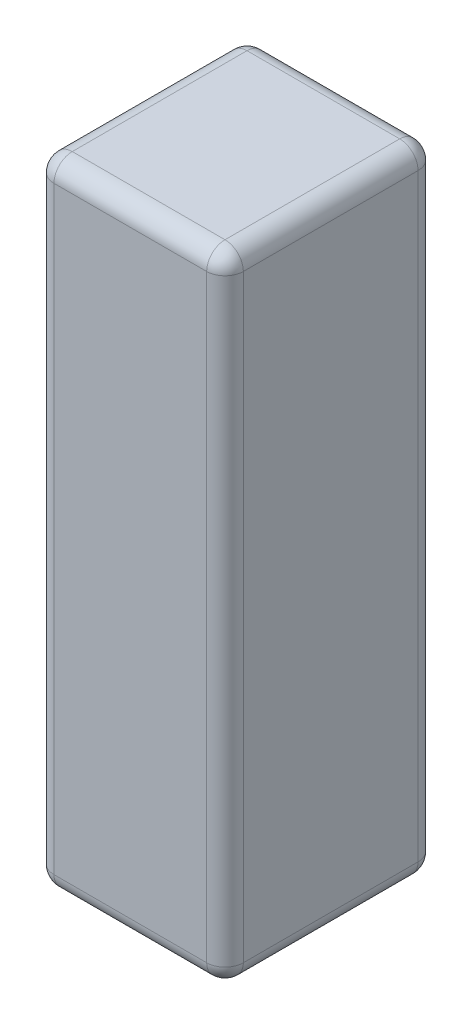
ISO-10303-21;
HEADER;
FILE_DESCRIPTION(('STEP AP214'),'2;1');
FILE_NAME('part.step','',(''),(''),'','','');
FILE_SCHEMA(('AUTOMOTIVE_DESIGN { 1 0 10303 214 1 1 1 1 }'));
ENDSEC;
DATA;
#1=APPLICATION_CONTEXT('core data for automotive mechanical design processes');
#2=APPLICATION_PROTOCOL_DEFINITION('international standard','automotive_design',2000,#1);
#3=PRODUCT_CONTEXT('',#1,'mechanical');
#4=PRODUCT('Part','Part','',(#3));
#5=PRODUCT_RELATED_PRODUCT_CATEGORY('part','',(#4));
#6=PRODUCT_DEFINITION_FORMATION('','',#4);
#7=PRODUCT_DEFINITION_CONTEXT('part definition',#1,'design');
#8=PRODUCT_DEFINITION('design','',#6,#7);
#9=PRODUCT_DEFINITION_SHAPE('','',#8);
#10=(LENGTH_UNIT() NAMED_UNIT(*) SI_UNIT(.MILLI.,.METRE.));
#11=(NAMED_UNIT(*) PLANE_ANGLE_UNIT() SI_UNIT($,.RADIAN.));
#12=(NAMED_UNIT(*) SI_UNIT($,.STERADIAN.) SOLID_ANGLE_UNIT());
#13=UNCERTAINTY_MEASURE_WITH_UNIT(LENGTH_MEASURE(1.E-05),#10,'distance_accuracy_value','');
#14=(GEOMETRIC_REPRESENTATION_CONTEXT(3) GLOBAL_UNCERTAINTY_ASSIGNED_CONTEXT((#13)) GLOBAL_UNIT_ASSIGNED_CONTEXT((#10,
#11,#12)) REPRESENTATION_CONTEXT('',''));
#15=CARTESIAN_POINT('',(0.,0.,0.));
#16=DIRECTION('',(0.,0.,1.));
#17=DIRECTION('',(1.,0.,0.));
#18=AXIS2_PLACEMENT_3D('',#15,#16,#17);
#19=CARTESIAN_POINT('',(0.,104.,0.));
#20=DIRECTION('',(1.,0.,0.));
#21=DIRECTION('',(0.,0.,-1.));
#22=AXIS2_PLACEMENT_3D('',#19,#20,#21);
#23=PLANE('',#22);
#24=DIRECTION('',(0.,0.,1.));
#25=VECTOR('',#24,1.);
#26=CARTESIAN_POINT('',(0.,101.,0.));
#27=LINE('',#26,#25);
#28=CARTESIAN_POINT('',(0.,101.,-3.));
#29=VERTEX_POINT('',#28);
#30=CARTESIAN_POINT('',(0.,101.,-31.6));
#31=VERTEX_POINT('',#30);
#32=EDGE_CURVE('E153',#29,#31,#27,.F.);
#33=ORIENTED_EDGE('',*,*,#32,.T.);
#34=DIRECTION('',(0.,-1.,0.));
#35=VECTOR('',#34,1.);
#36=CARTESIAN_POINT('',(0.,104.,-31.6));
#37=LINE('',#36,#35);
#38=CARTESIAN_POINT('',(0.,3.,-31.6));
#39=VERTEX_POINT('',#38);
#40=EDGE_CURVE('E221',#31,#39,#37,.T.);
#41=ORIENTED_EDGE('',*,*,#40,.T.);
#42=DIRECTION('',(0.,0.,1.));
#43=VECTOR('',#42,1.);
#44=CARTESIAN_POINT('',(0.,3.,0.));
#45=LINE('',#44,#43);
#46=CARTESIAN_POINT('',(0.,3.,-3.));
#47=VERTEX_POINT('',#46);
#48=EDGE_CURVE('E280',#39,#47,#45,.T.);
#49=ORIENTED_EDGE('',*,*,#48,.T.);
#50=DIRECTION('',(0.,-1.,0.));
#51=VECTOR('',#50,1.);
#52=CARTESIAN_POINT('',(0.,104.,-3.));
#53=LINE('',#52,#51);
#54=EDGE_CURVE('E278',#47,#29,#53,.F.);
#55=ORIENTED_EDGE('',*,*,#54,.T.);
#56=EDGE_LOOP('',(#33,#41,#49,#55));
#57=FACE_BOUND('',#56,.T.);
#58=ADVANCED_FACE('F34',(#57),#23,.F.);
#59=CARTESIAN_POINT('',(0.,104.,0.));
#60=DIRECTION('',(0.,0.,-1.));
#61=DIRECTION('',(-1.,0.,0.));
#62=AXIS2_PLACEMENT_3D('',#59,#60,#61);
#63=PLANE('',#62);
#64=DIRECTION('',(1.,0.,0.));
#65=VECTOR('',#64,1.);
#66=CARTESIAN_POINT('',(0.,101.,0.));
#67=LINE('',#66,#65);
#68=CARTESIAN_POINT('',(28.,101.,0.));
#69=VERTEX_POINT('',#68);
#70=CARTESIAN_POINT('',(3.,101.,0.));
#71=VERTEX_POINT('',#70);
#72=EDGE_CURVE('E43',#69,#71,#67,.F.);
#73=ORIENTED_EDGE('',*,*,#72,.T.);
#74=DIRECTION('',(0.,-1.,0.));
#75=VECTOR('',#74,1.);
#76=CARTESIAN_POINT('',(3.,104.,0.));
#77=LINE('',#76,#75);
#78=CARTESIAN_POINT('',(3.,3.,0.));
#79=VERTEX_POINT('',#78);
#80=EDGE_CURVE('E11',#71,#79,#77,.T.);
#81=ORIENTED_EDGE('',*,*,#80,.T.);
#82=DIRECTION('',(1.,0.,0.));
#83=VECTOR('',#82,1.);
#84=CARTESIAN_POINT('',(31.,3.,0.));
#85=LINE('',#84,#83);
#86=CARTESIAN_POINT('',(28.,3.,0.));
#87=VERTEX_POINT('',#86);
#88=EDGE_CURVE('E227',#79,#87,#85,.T.);
#89=ORIENTED_EDGE('',*,*,#88,.T.);
#90=DIRECTION('',(0.,-1.,0.));
#91=VECTOR('',#90,1.);
#92=CARTESIAN_POINT('',(28.,104.,0.));
#93=LINE('',#92,#91);
#94=EDGE_CURVE('E54',#87,#69,#93,.F.);
#95=ORIENTED_EDGE('',*,*,#94,.T.);
#96=EDGE_LOOP('',(#73,#81,#89,#95));
#97=FACE_BOUND('',#96,.T.);
#98=ADVANCED_FACE('F318',(#97),#63,.F.);
#99=CARTESIAN_POINT('',(31.,104.,0.));
#100=DIRECTION('',(-1.,0.,0.));
#101=DIRECTION('',(0.,0.,1.));
#102=AXIS2_PLACEMENT_3D('',#99,#100,#101);
#103=PLANE('',#102);
#104=DIRECTION('',(0.,-1.,0.));
#105=VECTOR('',#104,1.);
#106=CARTESIAN_POINT('',(31.,104.,-31.6));
#107=LINE('',#106,#105);
#108=CARTESIAN_POINT('',(31.,3.,-31.6));
#109=VERTEX_POINT('',#108);
#110=CARTESIAN_POINT('',(31.,101.,-31.6));
#111=VERTEX_POINT('',#110);
#112=EDGE_CURVE('E216',#109,#111,#107,.F.);
#113=ORIENTED_EDGE('',*,*,#112,.T.);
#114=DIRECTION('',(0.,0.,-1.));
#115=VECTOR('',#114,1.);
#116=CARTESIAN_POINT('',(31.,101.,0.));
#117=LINE('',#116,#115);
#118=CARTESIAN_POINT('',(31.,101.,-3.));
#119=VERTEX_POINT('',#118);
#120=EDGE_CURVE('E219',#111,#119,#117,.F.);
#121=ORIENTED_EDGE('',*,*,#120,.T.);
#122=DIRECTION('',(0.,-1.,0.));
#123=VECTOR('',#122,1.);
#124=CARTESIAN_POINT('',(31.,104.,-3.));
#125=LINE('',#124,#123);
#126=CARTESIAN_POINT('',(31.,3.,-3.));
#127=VERTEX_POINT('',#126);
#128=EDGE_CURVE('E217',#119,#127,#125,.T.);
#129=ORIENTED_EDGE('',*,*,#128,.T.);
#130=DIRECTION('',(0.,0.,-1.));
#131=VECTOR('',#130,1.);
#132=CARTESIAN_POINT('',(31.,3.,-34.6));
#133=LINE('',#132,#131);
#134=EDGE_CURVE('E213',#127,#109,#133,.T.);
#135=ORIENTED_EDGE('',*,*,#134,.T.);
#136=EDGE_LOOP('',(#113,#121,#129,#135));
#137=FACE_BOUND('',#136,.T.);
#138=ADVANCED_FACE('F298',(#137),#103,.F.);
#139=CARTESIAN_POINT('',(0.,104.,-34.6));
#140=DIRECTION('',(0.,0.,1.));
#141=DIRECTION('',(1.,0.,0.));
#142=AXIS2_PLACEMENT_3D('',#139,#140,#141);
#143=PLANE('',#142);
#144=DIRECTION('',(-1.,0.,0.));
#145=VECTOR('',#144,1.);
#146=CARTESIAN_POINT('',(0.,3.,-34.6));
#147=LINE('',#146,#145);
#148=CARTESIAN_POINT('',(28.,3.,-34.6));
#149=VERTEX_POINT('',#148);
#150=CARTESIAN_POINT('',(3.,3.,-34.6));
#151=VERTEX_POINT('',#150);
#152=EDGE_CURVE('E257',#149,#151,#147,.T.);
#153=ORIENTED_EDGE('',*,*,#152,.T.);
#154=DIRECTION('',(0.,-1.,0.));
#155=VECTOR('',#154,1.);
#156=CARTESIAN_POINT('',(3.,104.,-34.6));
#157=LINE('',#156,#155);
#158=CARTESIAN_POINT('',(3.,101.,-34.6));
#159=VERTEX_POINT('',#158);
#160=EDGE_CURVE('E263',#151,#159,#157,.F.);
#161=ORIENTED_EDGE('',*,*,#160,.T.);
#162=DIRECTION('',(-1.,0.,0.));
#163=VECTOR('',#162,1.);
#164=CARTESIAN_POINT('',(0.,101.,-34.6));
#165=LINE('',#164,#163);
#166=CARTESIAN_POINT('',(28.,101.,-34.6));
#167=VERTEX_POINT('',#166);
#168=EDGE_CURVE('E260',#159,#167,#165,.F.);
#169=ORIENTED_EDGE('',*,*,#168,.T.);
#170=DIRECTION('',(0.,-1.,0.));
#171=VECTOR('',#170,1.);
#172=CARTESIAN_POINT('',(28.,104.,-34.6));
#173=LINE('',#172,#171);
#174=EDGE_CURVE('E252',#167,#149,#173,.T.);
#175=ORIENTED_EDGE('',*,*,#174,.T.);
#176=EDGE_LOOP('',(#153,#161,#169,#175));
#177=FACE_BOUND('',#176,.T.);
#178=ADVANCED_FACE('F261',(#177),#143,.F.);
#179=CARTESIAN_POINT('',(0.,104.,0.));
#180=DIRECTION('',(0.,-1.,0.));
#181=DIRECTION('',(0.,0.,-1.));
#182=AXIS2_PLACEMENT_3D('',#179,#180,#181);
#183=PLANE('',#182);
#184=DIRECTION('',(0.,0.,-1.));
#185=VECTOR('',#184,1.);
#186=CARTESIAN_POINT('',(28.,104.,0.));
#187=LINE('',#186,#185);
#188=CARTESIAN_POINT('',(28.,104.,-3.));
#189=VERTEX_POINT('',#188);
#190=CARTESIAN_POINT('',(28.,104.,-31.6));
#191=VERTEX_POINT('',#190);
#192=EDGE_CURVE('E132',#189,#191,#187,.T.);
#193=ORIENTED_EDGE('',*,*,#192,.T.);
#194=DIRECTION('',(-1.,0.,0.));
#195=VECTOR('',#194,1.);
#196=CARTESIAN_POINT('',(0.,104.,-31.6));
#197=LINE('',#196,#195);
#198=CARTESIAN_POINT('',(3.,104.,-31.6));
#199=VERTEX_POINT('',#198);
#200=EDGE_CURVE('E128',#191,#199,#197,.T.);
#201=ORIENTED_EDGE('',*,*,#200,.T.);
#202=DIRECTION('',(0.,0.,1.));
#203=VECTOR('',#202,1.);
#204=CARTESIAN_POINT('',(3.,104.,0.));
#205=LINE('',#204,#203);
#206=CARTESIAN_POINT('',(3.,104.,-3.));
#207=VERTEX_POINT('',#206);
#208=EDGE_CURVE('E122',#199,#207,#205,.T.);
#209=ORIENTED_EDGE('',*,*,#208,.T.);
#210=DIRECTION('',(1.,0.,0.));
#211=VECTOR('',#210,1.);
#212=CARTESIAN_POINT('',(0.,104.,-3.));
#213=LINE('',#212,#211);
#214=EDGE_CURVE('E125',#207,#189,#213,.T.);
#215=ORIENTED_EDGE('',*,*,#214,.T.);
#216=EDGE_LOOP('',(#193,#201,#209,#215));
#217=FACE_BOUND('',#216,.T.);
#218=ADVANCED_FACE('F124',(#217),#183,.F.);
#219=CARTESIAN_POINT('',(0.,0.,0.));
#220=DIRECTION('',(0.,-1.,0.));
#221=DIRECTION('',(0.,0.,-1.));
#222=AXIS2_PLACEMENT_3D('',#219,#220,#221);
#223=PLANE('',#222);
#224=DIRECTION('',(0.,0.,1.));
#225=VECTOR('',#224,1.);
#226=CARTESIAN_POINT('',(3.,0.,-34.6));
#227=LINE('',#226,#225);
#228=CARTESIAN_POINT('',(3.,0.,-3.));
#229=VERTEX_POINT('',#228);
#230=CARTESIAN_POINT('',(3.,0.,-31.6));
#231=VERTEX_POINT('',#230);
#232=EDGE_CURVE('E274',#229,#231,#227,.F.);
#233=ORIENTED_EDGE('',*,*,#232,.T.);
#234=DIRECTION('',(-1.,0.,0.));
#235=VECTOR('',#234,1.);
#236=CARTESIAN_POINT('',(31.,0.,-31.6));
#237=LINE('',#236,#235);
#238=CARTESIAN_POINT('',(28.,0.,-31.6));
#239=VERTEX_POINT('',#238);
#240=EDGE_CURVE('E276',#231,#239,#237,.F.);
#241=ORIENTED_EDGE('',*,*,#240,.T.);
#242=DIRECTION('',(0.,0.,-1.));
#243=VECTOR('',#242,1.);
#244=CARTESIAN_POINT('',(28.,0.,0.));
#245=LINE('',#244,#243);
#246=CARTESIAN_POINT('',(28.,0.,-3.));
#247=VERTEX_POINT('',#246);
#248=EDGE_CURVE('E211',#239,#247,#245,.F.);
#249=ORIENTED_EDGE('',*,*,#248,.T.);
#250=DIRECTION('',(1.,0.,0.));
#251=VECTOR('',#250,1.);
#252=CARTESIAN_POINT('',(0.,0.,-3.));
#253=LINE('',#252,#251);
#254=EDGE_CURVE('E268',#247,#229,#253,.F.);
#255=ORIENTED_EDGE('',*,*,#254,.T.);
#256=EDGE_LOOP('',(#233,#241,#249,#255));
#257=FACE_BOUND('',#256,.T.);
#258=ADVANCED_FACE('F357',(#257),#223,.T.);
#259=CARTESIAN_POINT('',(0.,3.,-3.));
#260=DIRECTION('',(-1.,0.,0.));
#261=DIRECTION('',(0.,0.,1.));
#262=AXIS2_PLACEMENT_3D('',#259,#260,#261);
#263=CYLINDRICAL_SURFACE('',#262,3.);
#264=CARTESIAN_POINT('',(28.,3.,-3.));
#265=DIRECTION('',(1.,0.,0.));
#266=DIRECTION('',(0.,0.,-1.));
#267=AXIS2_PLACEMENT_3D('',#264,#265,#266);
#268=CIRCLE('',#267,3.);
#269=EDGE_CURVE('E38',#87,#247,#268,.T.);
#270=ORIENTED_EDGE('',*,*,#269,.F.);
#271=ORIENTED_EDGE('',*,*,#88,.F.);
#272=CARTESIAN_POINT('',(3.,3.,-3.));
#273=DIRECTION('',(-1.,0.,0.));
#274=DIRECTION('',(0.,0.,1.));
#275=AXIS2_PLACEMENT_3D('',#272,#273,#274);
#276=CIRCLE('',#275,3.);
#277=EDGE_CURVE('E191',#229,#79,#276,.T.);
#278=ORIENTED_EDGE('',*,*,#277,.F.);
#279=ORIENTED_EDGE('',*,*,#254,.F.);
#280=EDGE_LOOP('',(#270,#271,#278,#279));
#281=FACE_BOUND('',#280,.T.);
#282=ADVANCED_FACE('F36',(#281),#263,.T.);
#283=CARTESIAN_POINT('',(28.,3.,-3.));
#284=DIRECTION('',(0.,0.,1.));
#285=DIRECTION('',(1.,0.,0.));
#286=AXIS2_PLACEMENT_3D('',#283,#284,#285);
#287=SPHERICAL_SURFACE('',#286,3.);
#288=CARTESIAN_POINT('',(28.,3.,-3.));
#289=DIRECTION('',(0.,-1.,0.));
#290=DIRECTION('',(0.,0.,-1.));
#291=AXIS2_PLACEMENT_3D('',#288,#289,#290);
#292=CIRCLE('',#291,3.);
#293=EDGE_CURVE('E186',#87,#127,#292,.F.);
#294=ORIENTED_EDGE('',*,*,#293,.F.);
#295=ORIENTED_EDGE('',*,*,#269,.T.);
#296=CARTESIAN_POINT('',(28.,3.,-3.));
#297=DIRECTION('',(0.,0.,1.));
#298=DIRECTION('',(1.,0.,0.));
#299=AXIS2_PLACEMENT_3D('',#296,#297,#298);
#300=CIRCLE('',#299,3.);
#301=EDGE_CURVE('E189',#127,#247,#300,.F.);
#302=ORIENTED_EDGE('',*,*,#301,.F.);
#303=EDGE_LOOP('',(#294,#295,#302));
#304=FACE_BOUND('',#303,.T.);
#305=ADVANCED_FACE('F203',(#304),#287,.T.);
#306=CARTESIAN_POINT('',(3.,3.,-3.));
#307=DIRECTION('',(0.,0.,1.));
#308=DIRECTION('',(1.,0.,0.));
#309=AXIS2_PLACEMENT_3D('',#306,#307,#308);
#310=SPHERICAL_SURFACE('',#309,3.);
#311=CARTESIAN_POINT('',(3.,3.,-3.));
#312=DIRECTION('',(0.,0.,1.));
#313=DIRECTION('',(1.,0.,0.));
#314=AXIS2_PLACEMENT_3D('',#311,#312,#313);
#315=CIRCLE('',#314,3.);
#316=EDGE_CURVE('E181',#229,#47,#315,.F.);
#317=ORIENTED_EDGE('',*,*,#316,.F.);
#318=ORIENTED_EDGE('',*,*,#277,.T.);
#319=CARTESIAN_POINT('',(3.,3.,-3.));
#320=DIRECTION('',(0.,-1.,0.));
#321=DIRECTION('',(0.,0.,-1.));
#322=AXIS2_PLACEMENT_3D('',#319,#320,#321);
#323=CIRCLE('',#322,3.);
#324=EDGE_CURVE('E184',#47,#79,#323,.F.);
#325=ORIENTED_EDGE('',*,*,#324,.F.);
#326=EDGE_LOOP('',(#317,#318,#325));
#327=FACE_BOUND('',#326,.T.);
#328=ADVANCED_FACE('F354',(#327),#310,.T.);
#329=CARTESIAN_POINT('',(28.,3.,0.));
#330=DIRECTION('',(0.,0.,1.));
#331=DIRECTION('',(1.,0.,0.));
#332=AXIS2_PLACEMENT_3D('',#329,#330,#331);
#333=CYLINDRICAL_SURFACE('',#332,3.);
#334=ORIENTED_EDGE('',*,*,#301,.T.);
#335=ORIENTED_EDGE('',*,*,#248,.F.);
#336=CARTESIAN_POINT('',(28.,3.,-31.6));
#337=DIRECTION('',(0.,0.,-1.));
#338=DIRECTION('',(-1.,0.,0.));
#339=AXIS2_PLACEMENT_3D('',#336,#337,#338);
#340=CIRCLE('',#339,3.);
#341=EDGE_CURVE('E176',#109,#239,#340,.T.);
#342=ORIENTED_EDGE('',*,*,#341,.F.);
#343=ORIENTED_EDGE('',*,*,#134,.F.);
#344=EDGE_LOOP('',(#334,#335,#342,#343));
#345=FACE_BOUND('',#344,.T.);
#346=ADVANCED_FACE('F209',(#345),#333,.T.);
#347=CARTESIAN_POINT('',(28.,104.,-3.));
#348=DIRECTION('',(0.,-1.,0.));
#349=DIRECTION('',(0.,0.,-1.));
#350=AXIS2_PLACEMENT_3D('',#347,#348,#349);
#351=CYLINDRICAL_SURFACE('',#350,3.);
#352=ORIENTED_EDGE('',*,*,#293,.T.);
#353=ORIENTED_EDGE('',*,*,#128,.F.);
#354=CARTESIAN_POINT('',(28.,101.,-3.));
#355=DIRECTION('',(0.,1.,0.));
#356=DIRECTION('',(0.,0.,1.));
#357=AXIS2_PLACEMENT_3D('',#354,#355,#356);
#358=CIRCLE('',#357,3.);
#359=EDGE_CURVE('E173',#69,#119,#358,.T.);
#360=ORIENTED_EDGE('',*,*,#359,.F.);
#361=ORIENTED_EDGE('',*,*,#94,.F.);
#362=EDGE_LOOP('',(#352,#353,#360,#361));
#363=FACE_BOUND('',#362,.T.);
#364=ADVANCED_FACE('F302',(#363),#351,.T.);
#365=CARTESIAN_POINT('',(0.,101.,-3.));
#366=DIRECTION('',(1.,0.,0.));
#367=DIRECTION('',(0.,0.,-1.));
#368=AXIS2_PLACEMENT_3D('',#365,#366,#367);
#369=CYLINDRICAL_SURFACE('',#368,3.);
#370=CARTESIAN_POINT('',(3.,101.,-3.));
#371=DIRECTION('',(-1.,0.,0.));
#372=DIRECTION('',(0.,0.,1.));
#373=AXIS2_PLACEMENT_3D('',#370,#371,#372);
#374=CIRCLE('',#373,3.);
#375=EDGE_CURVE('E138',#71,#207,#374,.T.);
#376=ORIENTED_EDGE('',*,*,#375,.F.);
#377=ORIENTED_EDGE('',*,*,#72,.F.);
#378=CARTESIAN_POINT('',(28.,101.,-3.));
#379=DIRECTION('',(1.,0.,0.));
#380=DIRECTION('',(0.,0.,-1.));
#381=AXIS2_PLACEMENT_3D('',#378,#379,#380);
#382=CIRCLE('',#381,3.);
#383=EDGE_CURVE('E141',#189,#69,#382,.T.);
#384=ORIENTED_EDGE('',*,*,#383,.F.);
#385=ORIENTED_EDGE('',*,*,#214,.F.);
#386=EDGE_LOOP('',(#376,#377,#384,#385));
#387=FACE_BOUND('',#386,.T.);
#388=ADVANCED_FACE('F137',(#387),#369,.T.);
#389=CARTESIAN_POINT('',(3.,104.,-3.));
#390=DIRECTION('',(0.,-1.,0.));
#391=DIRECTION('',(0.,0.,-1.));
#392=AXIS2_PLACEMENT_3D('',#389,#390,#391);
#393=CYLINDRICAL_SURFACE('',#392,3.);
#394=ORIENTED_EDGE('',*,*,#324,.T.);
#395=ORIENTED_EDGE('',*,*,#80,.F.);
#396=CARTESIAN_POINT('',(3.,101.,-3.));
#397=DIRECTION('',(0.,1.,0.));
#398=DIRECTION('',(0.,0.,1.));
#399=AXIS2_PLACEMENT_3D('',#396,#397,#398);
#400=CIRCLE('',#399,3.);
#401=EDGE_CURVE('E150',#29,#71,#400,.T.);
#402=ORIENTED_EDGE('',*,*,#401,.F.);
#403=ORIENTED_EDGE('',*,*,#54,.F.);
#404=EDGE_LOOP('',(#394,#395,#402,#403));
#405=FACE_BOUND('',#404,.T.);
#406=ADVANCED_FACE('F356',(#405),#393,.T.);
#407=CARTESIAN_POINT('',(3.,3.,0.));
#408=DIRECTION('',(0.,0.,-1.));
#409=DIRECTION('',(-1.,0.,0.));
#410=AXIS2_PLACEMENT_3D('',#407,#408,#409);
#411=CYLINDRICAL_SURFACE('',#410,3.);
#412=ORIENTED_EDGE('',*,*,#316,.T.);
#413=ORIENTED_EDGE('',*,*,#48,.F.);
#414=CARTESIAN_POINT('',(3.,3.,-31.6));
#415=DIRECTION('',(0.,0.,-1.));
#416=DIRECTION('',(-1.,0.,0.));
#417=AXIS2_PLACEMENT_3D('',#414,#415,#416);
#418=CIRCLE('',#417,3.);
#419=EDGE_CURVE('E168',#231,#39,#418,.T.);
#420=ORIENTED_EDGE('',*,*,#419,.F.);
#421=ORIENTED_EDGE('',*,*,#232,.F.);
#422=EDGE_LOOP('',(#412,#413,#420,#421));
#423=FACE_BOUND('',#422,.T.);
#424=ADVANCED_FACE('F352',(#423),#411,.T.);
#425=CARTESIAN_POINT('',(0.,3.,-31.6));
#426=DIRECTION('',(1.,0.,0.));
#427=DIRECTION('',(0.,0.,-1.));
#428=AXIS2_PLACEMENT_3D('',#425,#426,#427);
#429=CYLINDRICAL_SURFACE('',#428,3.);
#430=CARTESIAN_POINT('',(28.,3.,-31.6));
#431=DIRECTION('',(1.,0.,0.));
#432=DIRECTION('',(0.,0.,-1.));
#433=AXIS2_PLACEMENT_3D('',#430,#431,#432);
#434=CIRCLE('',#433,3.);
#435=EDGE_CURVE('E178',#239,#149,#434,.T.);
#436=ORIENTED_EDGE('',*,*,#435,.F.);
#437=ORIENTED_EDGE('',*,*,#240,.F.);
#438=CARTESIAN_POINT('',(3.,3.,-31.6));
#439=DIRECTION('',(-1.,0.,0.));
#440=DIRECTION('',(0.,0.,1.));
#441=AXIS2_PLACEMENT_3D('',#438,#439,#440);
#442=CIRCLE('',#441,3.);
#443=EDGE_CURVE('E165',#151,#231,#442,.T.);
#444=ORIENTED_EDGE('',*,*,#443,.F.);
#445=ORIENTED_EDGE('',*,*,#152,.F.);
#446=EDGE_LOOP('',(#436,#437,#444,#445));
#447=FACE_BOUND('',#446,.T.);
#448=ADVANCED_FACE('F314',(#447),#429,.T.);
#449=CARTESIAN_POINT('',(28.,3.,-31.6));
#450=DIRECTION('',(0.,0.,1.));
#451=DIRECTION('',(1.,0.,0.));
#452=AXIS2_PLACEMENT_3D('',#449,#450,#451);
#453=SPHERICAL_SURFACE('',#452,3.);
#454=ORIENTED_EDGE('',*,*,#341,.T.);
#455=ORIENTED_EDGE('',*,*,#435,.T.);
#456=CARTESIAN_POINT('',(28.,3.,-31.6));
#457=DIRECTION('',(0.,-1.,0.));
#458=DIRECTION('',(0.,0.,-1.));
#459=AXIS2_PLACEMENT_3D('',#456,#457,#458);
#460=CIRCLE('',#459,3.);
#461=EDGE_CURVE('E157',#109,#149,#460,.F.);
#462=ORIENTED_EDGE('',*,*,#461,.F.);
#463=EDGE_LOOP('',(#454,#455,#462));
#464=FACE_BOUND('',#463,.T.);
#465=ADVANCED_FACE('F306',(#464),#453,.T.);
#466=CARTESIAN_POINT('',(28.,101.,-3.));
#467=DIRECTION('',(0.,0.,1.));
#468=DIRECTION('',(1.,0.,0.));
#469=AXIS2_PLACEMENT_3D('',#466,#467,#468);
#470=SPHERICAL_SURFACE('',#469,3.);
#471=ORIENTED_EDGE('',*,*,#383,.T.);
#472=ORIENTED_EDGE('',*,*,#359,.T.);
#473=CARTESIAN_POINT('',(28.,101.,-3.));
#474=DIRECTION('',(0.,0.,1.));
#475=DIRECTION('',(1.,0.,0.));
#476=AXIS2_PLACEMENT_3D('',#473,#474,#475);
#477=CIRCLE('',#476,3.);
#478=EDGE_CURVE('E154',#189,#119,#477,.F.);
#479=ORIENTED_EDGE('',*,*,#478,.F.);
#480=EDGE_LOOP('',(#471,#472,#479));
#481=FACE_BOUND('',#480,.T.);
#482=ADVANCED_FACE('F304',(#481),#470,.T.);
#483=CARTESIAN_POINT('',(3.,101.,-3.));
#484=DIRECTION('',(0.,0.,1.));
#485=DIRECTION('',(1.,0.,0.));
#486=AXIS2_PLACEMENT_3D('',#483,#484,#485);
#487=SPHERICAL_SURFACE('',#486,3.);
#488=ORIENTED_EDGE('',*,*,#401,.T.);
#489=ORIENTED_EDGE('',*,*,#375,.T.);
#490=CARTESIAN_POINT('',(3.,101.,-3.));
#491=DIRECTION('',(0.,0.,1.));
#492=DIRECTION('',(1.,0.,0.));
#493=AXIS2_PLACEMENT_3D('',#490,#491,#492);
#494=CIRCLE('',#493,3.);
#495=EDGE_CURVE('E147',#29,#207,#494,.F.);
#496=ORIENTED_EDGE('',*,*,#495,.F.);
#497=EDGE_LOOP('',(#488,#489,#496));
#498=FACE_BOUND('',#497,.T.);
#499=ADVANCED_FACE('F146',(#498),#487,.T.);
#500=CARTESIAN_POINT('',(3.,3.,-31.6));
#501=DIRECTION('',(0.,0.,1.));
#502=DIRECTION('',(1.,0.,0.));
#503=AXIS2_PLACEMENT_3D('',#500,#501,#502);
#504=SPHERICAL_SURFACE('',#503,3.);
#505=ORIENTED_EDGE('',*,*,#443,.T.);
#506=ORIENTED_EDGE('',*,*,#419,.T.);
#507=CARTESIAN_POINT('',(3.,3.,-31.6));
#508=DIRECTION('',(0.,-1.,0.));
#509=DIRECTION('',(0.,0.,-1.));
#510=AXIS2_PLACEMENT_3D('',#507,#508,#509);
#511=CIRCLE('',#510,3.);
#512=EDGE_CURVE('E155',#151,#39,#511,.F.);
#513=ORIENTED_EDGE('',*,*,#512,.F.);
#514=EDGE_LOOP('',(#505,#506,#513));
#515=FACE_BOUND('',#514,.T.);
#516=ADVANCED_FACE('F312',(#515),#504,.T.);
#517=CARTESIAN_POINT('',(28.,104.,-31.6));
#518=DIRECTION('',(0.,-1.,0.));
#519=DIRECTION('',(0.,0.,-1.));
#520=AXIS2_PLACEMENT_3D('',#517,#518,#519);
#521=CYLINDRICAL_SURFACE('',#520,3.);
#522=ORIENTED_EDGE('',*,*,#461,.T.);
#523=ORIENTED_EDGE('',*,*,#174,.F.);
#524=CARTESIAN_POINT('',(28.,101.,-31.6));
#525=DIRECTION('',(0.,1.,0.));
#526=DIRECTION('',(0.,0.,1.));
#527=AXIS2_PLACEMENT_3D('',#524,#525,#526);
#528=CIRCLE('',#527,3.);
#529=EDGE_CURVE('E159',#111,#167,#528,.T.);
#530=ORIENTED_EDGE('',*,*,#529,.F.);
#531=ORIENTED_EDGE('',*,*,#112,.F.);
#532=EDGE_LOOP('',(#522,#523,#530,#531));
#533=FACE_BOUND('',#532,.T.);
#534=ADVANCED_FACE('F254',(#533),#521,.T.);
#535=CARTESIAN_POINT('',(28.,101.,0.));
#536=DIRECTION('',(0.,0.,-1.));
#537=DIRECTION('',(-1.,0.,0.));
#538=AXIS2_PLACEMENT_3D('',#535,#536,#537);
#539=CYLINDRICAL_SURFACE('',#538,3.);
#540=ORIENTED_EDGE('',*,*,#478,.T.);
#541=ORIENTED_EDGE('',*,*,#120,.F.);
#542=CARTESIAN_POINT('',(28.,101.,-31.6));
#543=DIRECTION('',(0.,0.,-1.));
#544=DIRECTION('',(-1.,0.,0.));
#545=AXIS2_PLACEMENT_3D('',#542,#543,#544);
#546=CIRCLE('',#545,3.);
#547=EDGE_CURVE('E241',#191,#111,#546,.T.);
#548=ORIENTED_EDGE('',*,*,#547,.F.);
#549=ORIENTED_EDGE('',*,*,#192,.F.);
#550=EDGE_LOOP('',(#540,#541,#548,#549));
#551=FACE_BOUND('',#550,.T.);
#552=ADVANCED_FACE('F297',(#551),#539,.T.);
#553=CARTESIAN_POINT('',(3.,101.,0.));
#554=DIRECTION('',(0.,0.,1.));
#555=DIRECTION('',(1.,0.,0.));
#556=AXIS2_PLACEMENT_3D('',#553,#554,#555);
#557=CYLINDRICAL_SURFACE('',#556,3.);
#558=ORIENTED_EDGE('',*,*,#495,.T.);
#559=ORIENTED_EDGE('',*,*,#208,.F.);
#560=CARTESIAN_POINT('',(3.,101.,-31.6));
#561=DIRECTION('',(0.,0.,-1.));
#562=DIRECTION('',(0.,1.,0.));
#563=AXIS2_PLACEMENT_3D('',#560,#561,#562);
#564=CIRCLE('',#563,3.);
#565=EDGE_CURVE('E238',#31,#199,#564,.T.);
#566=ORIENTED_EDGE('',*,*,#565,.F.);
#567=ORIENTED_EDGE('',*,*,#32,.F.);
#568=EDGE_LOOP('',(#558,#559,#566,#567));
#569=FACE_BOUND('',#568,.T.);
#570=ADVANCED_FACE('F152',(#569),#557,.T.);
#571=CARTESIAN_POINT('',(3.,104.,-31.6));
#572=DIRECTION('',(0.,-1.,0.));
#573=DIRECTION('',(0.,0.,-1.));
#574=AXIS2_PLACEMENT_3D('',#571,#572,#573);
#575=CYLINDRICAL_SURFACE('',#574,3.);
#576=ORIENTED_EDGE('',*,*,#512,.T.);
#577=ORIENTED_EDGE('',*,*,#40,.F.);
#578=CARTESIAN_POINT('',(3.,101.,-31.6));
#579=DIRECTION('',(0.,1.,0.));
#580=DIRECTION('',(0.,0.,1.));
#581=AXIS2_PLACEMENT_3D('',#578,#579,#580);
#582=CIRCLE('',#581,3.);
#583=EDGE_CURVE('E235',#159,#31,#582,.T.);
#584=ORIENTED_EDGE('',*,*,#583,.F.);
#585=ORIENTED_EDGE('',*,*,#160,.F.);
#586=EDGE_LOOP('',(#576,#577,#584,#585));
#587=FACE_BOUND('',#586,.T.);
#588=ADVANCED_FACE('F287',(#587),#575,.T.);
#589=CARTESIAN_POINT('',(28.,101.,-31.6));
#590=DIRECTION('',(0.,0.,1.));
#591=DIRECTION('',(1.,0.,0.));
#592=AXIS2_PLACEMENT_3D('',#589,#590,#591);
#593=SPHERICAL_SURFACE('',#592,3.);
#594=ORIENTED_EDGE('',*,*,#547,.T.);
#595=ORIENTED_EDGE('',*,*,#529,.T.);
#596=CARTESIAN_POINT('',(28.,101.,-31.6));
#597=DIRECTION('',(1.,0.,0.));
#598=DIRECTION('',(0.,0.,-1.));
#599=AXIS2_PLACEMENT_3D('',#596,#597,#598);
#600=CIRCLE('',#599,3.);
#601=EDGE_CURVE('E233',#191,#167,#600,.F.);
#602=ORIENTED_EDGE('',*,*,#601,.F.);
#603=EDGE_LOOP('',(#594,#595,#602));
#604=FACE_BOUND('',#603,.T.);
#605=ADVANCED_FACE('F248',(#604),#593,.T.);
#606=CARTESIAN_POINT('',(3.,101.,-31.6));
#607=DIRECTION('',(0.,0.,1.));
#608=DIRECTION('',(1.,0.,0.));
#609=AXIS2_PLACEMENT_3D('',#606,#607,#608);
#610=SPHERICAL_SURFACE('',#609,3.);
#611=ORIENTED_EDGE('',*,*,#583,.T.);
#612=ORIENTED_EDGE('',*,*,#565,.T.);
#613=CARTESIAN_POINT('',(3.,101.,-31.6));
#614=DIRECTION('',(-1.,0.,0.));
#615=DIRECTION('',(0.,0.,1.));
#616=AXIS2_PLACEMENT_3D('',#613,#614,#615);
#617=CIRCLE('',#616,3.);
#618=EDGE_CURVE('E231',#159,#199,#617,.F.);
#619=ORIENTED_EDGE('',*,*,#618,.F.);
#620=EDGE_LOOP('',(#611,#612,#619));
#621=FACE_BOUND('',#620,.T.);
#622=ADVANCED_FACE('F290',(#621),#610,.T.);
#623=CARTESIAN_POINT('',(0.,101.,-31.6));
#624=DIRECTION('',(-1.,0.,0.));
#625=DIRECTION('',(0.,0.,1.));
#626=AXIS2_PLACEMENT_3D('',#623,#624,#625);
#627=CYLINDRICAL_SURFACE('',#626,3.);
#628=ORIENTED_EDGE('',*,*,#601,.T.);
#629=ORIENTED_EDGE('',*,*,#168,.F.);
#630=ORIENTED_EDGE('',*,*,#618,.T.);
#631=ORIENTED_EDGE('',*,*,#200,.F.);
#632=EDGE_LOOP('',(#628,#629,#630,#631));
#633=FACE_BOUND('',#632,.T.);
#634=ADVANCED_FACE('F291',(#633),#627,.T.);
#635=CLOSED_SHELL('',(#58,#98,#138,#178,#218,#258,#282,#305,#328,#346,#364,#388,#406,#424,#448,
#465,#482,#499,#516,#534,#552,#570,#588,#605,#622,#634));
#636=MANIFOLD_SOLID_BREP('B2',#635);
#637=ADVANCED_BREP_SHAPE_REPRESENTATION('',(#18,#636),#14);
#638=SHAPE_DEFINITION_REPRESENTATION(#9,#637);
ENDSEC;
END-ISO-10303-21;
